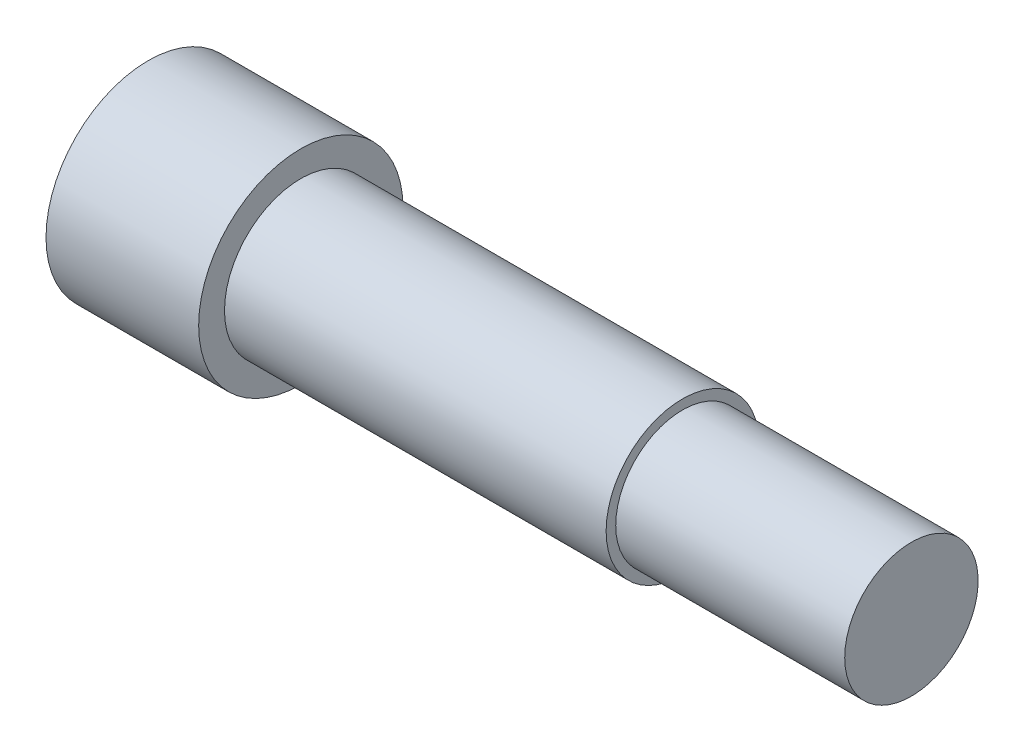
ISO-10303-21;
HEADER;
FILE_DESCRIPTION(('STEP AP214'),'2;1');
FILE_NAME('part.step','',(''),(''),'','','');
FILE_SCHEMA(('AUTOMOTIVE_DESIGN { 1 0 10303 214 1 1 1 1 }'));
ENDSEC;
DATA;
#1=APPLICATION_CONTEXT('core data for automotive mechanical design processes');
#2=APPLICATION_PROTOCOL_DEFINITION('international standard','automotive_design',2000,#1);
#3=PRODUCT_CONTEXT('',#1,'mechanical');
#4=PRODUCT('Part','Part','',(#3));
#5=PRODUCT_RELATED_PRODUCT_CATEGORY('part','',(#4));
#6=PRODUCT_DEFINITION_FORMATION('','',#4);
#7=PRODUCT_DEFINITION_CONTEXT('part definition',#1,'design');
#8=PRODUCT_DEFINITION('design','',#6,#7);
#9=PRODUCT_DEFINITION_SHAPE('','',#8);
#10=(LENGTH_UNIT() NAMED_UNIT(*) SI_UNIT(.MILLI.,.METRE.));
#11=(NAMED_UNIT(*) PLANE_ANGLE_UNIT() SI_UNIT($,.RADIAN.));
#12=(NAMED_UNIT(*) SI_UNIT($,.STERADIAN.) SOLID_ANGLE_UNIT());
#13=UNCERTAINTY_MEASURE_WITH_UNIT(LENGTH_MEASURE(1.E-05),#10,'distance_accuracy_value','');
#14=(GEOMETRIC_REPRESENTATION_CONTEXT(3) GLOBAL_UNCERTAINTY_ASSIGNED_CONTEXT((#13)) GLOBAL_UNIT_ASSIGNED_CONTEXT((#10,
#11,#12)) REPRESENTATION_CONTEXT('',''));
#15=CARTESIAN_POINT('',(0.,0.,0.));
#16=DIRECTION('',(0.,0.,1.));
#17=DIRECTION('',(1.,0.,0.));
#18=AXIS2_PLACEMENT_3D('',#15,#16,#17);
#19=CARTESIAN_POINT('',(0.,8.500000018,0.));
#20=DIRECTION('',(1.,0.,0.));
#21=DIRECTION('',(0.,0.,-1.));
#22=AXIS2_PLACEMENT_3D('',#19,#20,#21);
#23=PLANE('',#22);
#24=CARTESIAN_POINT('',(0.,0.,0.));
#25=DIRECTION('',(-1.,0.,0.));
#26=DIRECTION('',(0.,0.,1.));
#27=AXIS2_PLACEMENT_3D('',#24,#25,#26);
#28=CIRCLE('',#27,8.500000018);
#29=CARTESIAN_POINT('',(0.,0.,8.500000018));
#30=VERTEX_POINT('',#29);
#31=EDGE_CURVE('E66',#30,#30,#28,.T.);
#32=ORIENTED_EDGE('',*,*,#31,.T.);
#33=EDGE_LOOP('',(#32));
#34=FACE_BOUND('',#33,.T.);
#35=ADVANCED_FACE('F44',(#34),#23,.F.);
#36=CARTESIAN_POINT('',(63.5,0.,0.));
#37=DIRECTION('',(-1.,0.,0.));
#38=DIRECTION('',(0.,0.,1.));
#39=AXIS2_PLACEMENT_3D('',#36,#37,#38);
#40=PLANE('',#39);
#41=CARTESIAN_POINT('',(63.5,0.,0.));
#42=DIRECTION('',(-1.,0.,0.));
#43=DIRECTION('',(0.,0.,1.));
#44=AXIS2_PLACEMENT_3D('',#41,#42,#43);
#45=CIRCLE('',#44,5.5499);
#46=CARTESIAN_POINT('',(63.5,0.,5.5499));
#47=VERTEX_POINT('',#46);
#48=EDGE_CURVE('E10',#47,#47,#45,.T.);
#49=ORIENTED_EDGE('',*,*,#48,.F.);
#50=EDGE_LOOP('',(#49));
#51=FACE_BOUND('',#50,.T.);
#52=ADVANCED_FACE('F97',(#51),#40,.F.);
#53=CARTESIAN_POINT('',(0.,0.,0.));
#54=DIRECTION('',(-1.,0.,0.));
#55=DIRECTION('',(0.,0.,1.));
#56=AXIS2_PLACEMENT_3D('',#53,#54,#55);
#57=CYLINDRICAL_SURFACE('',#56,5.5499);
#58=CARTESIAN_POINT('',(44.45,0.,0.));
#59=DIRECTION('',(-1.,0.,0.));
#60=DIRECTION('',(0.,0.,1.));
#61=AXIS2_PLACEMENT_3D('',#58,#59,#60);
#62=CIRCLE('',#61,5.5499);
#63=CARTESIAN_POINT('',(44.45,0.,5.5499));
#64=VERTEX_POINT('',#63);
#65=EDGE_CURVE('E50',#64,#64,#62,.T.);
#66=ORIENTED_EDGE('',*,*,#65,.F.);
#67=EDGE_LOOP('',(#66));
#68=FACE_BOUND('',#67,.T.);
#69=ORIENTED_EDGE('',*,*,#48,.T.);
#70=EDGE_LOOP('',(#69));
#71=FACE_BOUND('',#70,.T.);
#72=ADVANCED_FACE('F91',(#68,#71),#57,.T.);
#73=CARTESIAN_POINT('',(44.45,6.35,0.));
#74=DIRECTION('',(-1.,0.,0.));
#75=DIRECTION('',(0.,0.,1.));
#76=AXIS2_PLACEMENT_3D('',#73,#74,#75);
#77=PLANE('',#76);
#78=CARTESIAN_POINT('',(44.45,0.,0.));
#79=DIRECTION('',(-1.,0.,0.));
#80=DIRECTION('',(0.,0.,1.));
#81=AXIS2_PLACEMENT_3D('',#78,#79,#80);
#82=CIRCLE('',#81,6.35);
#83=CARTESIAN_POINT('',(44.45,0.,6.35));
#84=VERTEX_POINT('',#83);
#85=EDGE_CURVE('E54',#84,#84,#82,.T.);
#86=ORIENTED_EDGE('',*,*,#85,.F.);
#87=EDGE_LOOP('',(#86));
#88=FACE_BOUND('',#87,.T.);
#89=ORIENTED_EDGE('',*,*,#65,.T.);
#90=EDGE_LOOP('',(#89));
#91=FACE_BOUND('',#90,.T.);
#92=ADVANCED_FACE('F86',(#88,#91),#77,.F.);
#93=CARTESIAN_POINT('',(0.,0.,0.));
#94=DIRECTION('',(-1.,0.,0.));
#95=DIRECTION('',(0.,0.,1.));
#96=AXIS2_PLACEMENT_3D('',#93,#94,#95);
#97=CYLINDRICAL_SURFACE('',#96,6.35);
#98=CARTESIAN_POINT('',(12.7,0.,0.));
#99=DIRECTION('',(-1.,0.,0.));
#100=DIRECTION('',(0.,0.,1.));
#101=AXIS2_PLACEMENT_3D('',#98,#99,#100);
#102=CIRCLE('',#101,6.35);
#103=CARTESIAN_POINT('',(12.7,0.,6.35));
#104=VERTEX_POINT('',#103);
#105=EDGE_CURVE('E58',#104,#104,#102,.T.);
#106=ORIENTED_EDGE('',*,*,#105,.F.);
#107=EDGE_LOOP('',(#106));
#108=FACE_BOUND('',#107,.T.);
#109=ORIENTED_EDGE('',*,*,#85,.T.);
#110=EDGE_LOOP('',(#109));
#111=FACE_BOUND('',#110,.T.);
#112=ADVANCED_FACE('F80',(#108,#111),#97,.T.);
#113=CARTESIAN_POINT('',(12.7,6.35,0.));
#114=DIRECTION('',(-1.,0.,0.));
#115=DIRECTION('',(0.,0.,1.));
#116=AXIS2_PLACEMENT_3D('',#113,#114,#115);
#117=PLANE('',#116);
#118=CARTESIAN_POINT('',(12.7,0.,0.));
#119=DIRECTION('',(-1.,0.,0.));
#120=DIRECTION('',(0.,0.,1.));
#121=AXIS2_PLACEMENT_3D('',#118,#119,#120);
#122=CIRCLE('',#121,8.500000018);
#123=CARTESIAN_POINT('',(12.7,0.,8.500000018));
#124=VERTEX_POINT('',#123);
#125=EDGE_CURVE('E63',#124,#124,#122,.T.);
#126=ORIENTED_EDGE('',*,*,#125,.F.);
#127=EDGE_LOOP('',(#126));
#128=FACE_BOUND('',#127,.T.);
#129=ORIENTED_EDGE('',*,*,#105,.T.);
#130=EDGE_LOOP('',(#129));
#131=FACE_BOUND('',#130,.T.);
#132=ADVANCED_FACE('F74',(#128,#131),#117,.F.);
#133=CARTESIAN_POINT('',(0.,0.,0.));
#134=DIRECTION('',(-1.,0.,0.));
#135=DIRECTION('',(0.,0.,1.));
#136=AXIS2_PLACEMENT_3D('',#133,#134,#135);
#137=CYLINDRICAL_SURFACE('',#136,8.500000018);
#138=ORIENTED_EDGE('',*,*,#31,.F.);
#139=EDGE_LOOP('',(#138));
#140=FACE_BOUND('',#139,.T.);
#141=ORIENTED_EDGE('',*,*,#125,.T.);
#142=EDGE_LOOP('',(#141));
#143=FACE_BOUND('',#142,.T.);
#144=ADVANCED_FACE('F71',(#140,#143),#137,.T.);
#145=CLOSED_SHELL('',(#35,#52,#72,#92,#112,#132,#144));
#146=MANIFOLD_SOLID_BREP('B2',#145);
#147=ADVANCED_BREP_SHAPE_REPRESENTATION('',(#18,#146),#14);
#148=SHAPE_DEFINITION_REPRESENTATION(#9,#147);
ENDSEC;
END-ISO-10303-21;
